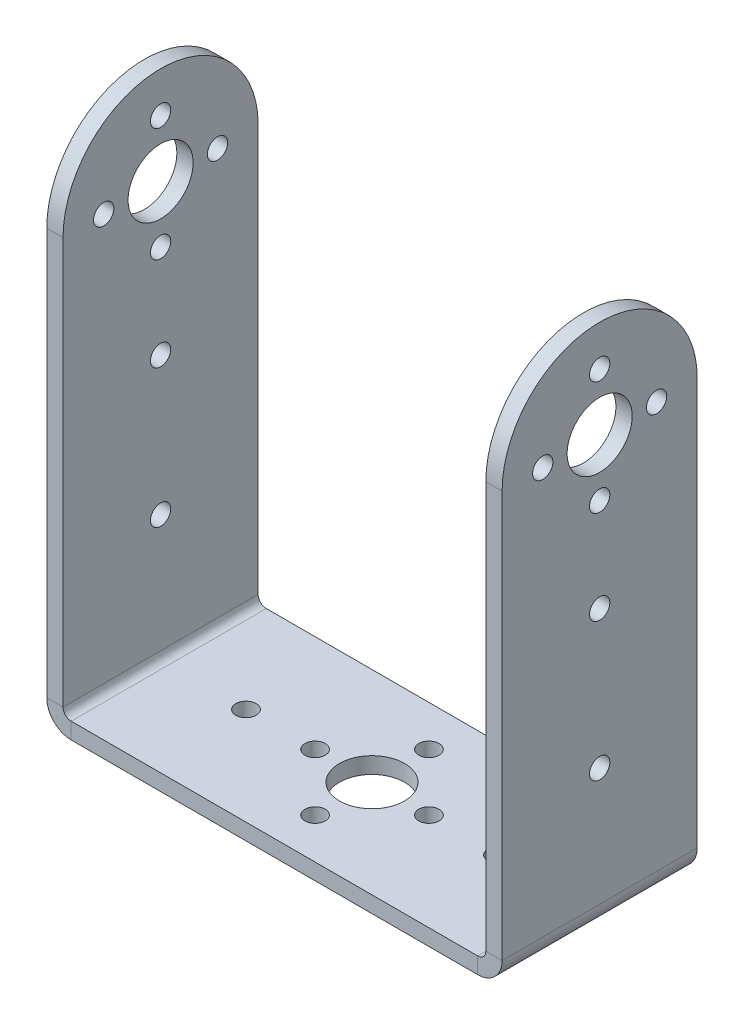
ISO-10303-21;
HEADER;
FILE_DESCRIPTION(('STEP AP214'),'2;1');
FILE_NAME('part.step','',(''),(''),'','','');
FILE_SCHEMA(('AUTOMOTIVE_DESIGN { 1 0 10303 214 1 1 1 1 }'));
ENDSEC;
DATA;
#1=APPLICATION_CONTEXT('core data for automotive mechanical design processes');
#2=APPLICATION_PROTOCOL_DEFINITION('international standard','automotive_design',2000,#1);
#3=PRODUCT_CONTEXT('',#1,'mechanical');
#4=PRODUCT('Part','Part','',(#3));
#5=PRODUCT_RELATED_PRODUCT_CATEGORY('part','',(#4));
#6=PRODUCT_DEFINITION_FORMATION('','',#4);
#7=PRODUCT_DEFINITION_CONTEXT('part definition',#1,'design');
#8=PRODUCT_DEFINITION('design','',#6,#7);
#9=PRODUCT_DEFINITION_SHAPE('','',#8);
#10=(LENGTH_UNIT() NAMED_UNIT(*) SI_UNIT(.MILLI.,.METRE.));
#11=(NAMED_UNIT(*) PLANE_ANGLE_UNIT() SI_UNIT($,.RADIAN.));
#12=(NAMED_UNIT(*) SI_UNIT($,.STERADIAN.) SOLID_ANGLE_UNIT());
#13=UNCERTAINTY_MEASURE_WITH_UNIT(LENGTH_MEASURE(1.E-05),#10,'distance_accuracy_value','');
#14=(GEOMETRIC_REPRESENTATION_CONTEXT(3) GLOBAL_UNCERTAINTY_ASSIGNED_CONTEXT((#13)) GLOBAL_UNIT_ASSIGNED_CONTEXT((#10,
#11,#12)) REPRESENTATION_CONTEXT('',''));
#15=CARTESIAN_POINT('',(0.,0.,0.));
#16=DIRECTION('',(0.,0.,1.));
#17=DIRECTION('',(1.,0.,0.));
#18=AXIS2_PLACEMENT_3D('',#15,#16,#17);
#19=CARTESIAN_POINT('',(28.,0.,12.));
#20=DIRECTION('',(-1.,0.,0.));
#21=DIRECTION('',(0.,-1.,0.));
#22=AXIS2_PLACEMENT_3D('',#19,#20,#21);
#23=PLANE('',#22);
#24=CARTESIAN_POINT('',(28.,60.,0.));
#25=DIRECTION('',(1.,0.,0.));
#26=DIRECTION('',(0.,0.,-1.));
#27=AXIS2_PLACEMENT_3D('',#24,#25,#26);
#28=CIRCLE('',#27,1.25);
#29=CARTESIAN_POINT('',(28.,60.,-1.25));
#30=VERTEX_POINT('',#29);
#31=EDGE_CURVE('E377',#30,#30,#28,.T.);
#32=ORIENTED_EDGE('',*,*,#31,.F.);
#33=EDGE_LOOP('',(#32));
#34=FACE_BOUND('',#33,.T.);
#35=CARTESIAN_POINT('',(28.,53.,-7.));
#36=DIRECTION('',(1.,0.,0.));
#37=DIRECTION('',(0.,0.,-1.));
#38=AXIS2_PLACEMENT_3D('',#35,#36,#37);
#39=CIRCLE('',#38,1.25);
#40=CARTESIAN_POINT('',(28.,53.,-8.25));
#41=VERTEX_POINT('',#40);
#42=EDGE_CURVE('E365',#41,#41,#39,.T.);
#43=ORIENTED_EDGE('',*,*,#42,.F.);
#44=EDGE_LOOP('',(#43));
#45=FACE_BOUND('',#44,.T.);
#46=CARTESIAN_POINT('',(28.,46.,0.));
#47=DIRECTION('',(1.,0.,0.));
#48=DIRECTION('',(0.,0.,-1.));
#49=AXIS2_PLACEMENT_3D('',#46,#47,#48);
#50=CIRCLE('',#49,1.25);
#51=CARTESIAN_POINT('',(28.,46.,-1.25));
#52=VERTEX_POINT('',#51);
#53=EDGE_CURVE('E353',#52,#52,#50,.T.);
#54=ORIENTED_EDGE('',*,*,#53,.F.);
#55=EDGE_LOOP('',(#54));
#56=FACE_BOUND('',#55,.T.);
#57=CARTESIAN_POINT('',(28.,34.5,0.));
#58=DIRECTION('',(1.,0.,0.));
#59=DIRECTION('',(0.,0.,-1.));
#60=AXIS2_PLACEMENT_3D('',#57,#58,#59);
#61=CIRCLE('',#60,1.25);
#62=CARTESIAN_POINT('',(28.,34.5,-1.25));
#63=VERTEX_POINT('',#62);
#64=EDGE_CURVE('E329',#63,#63,#61,.T.);
#65=ORIENTED_EDGE('',*,*,#64,.F.);
#66=EDGE_LOOP('',(#65));
#67=FACE_BOUND('',#66,.T.);
#68=CARTESIAN_POINT('',(28.,17.5,0.));
#69=DIRECTION('',(1.,0.,0.));
#70=DIRECTION('',(0.,0.,-1.));
#71=AXIS2_PLACEMENT_3D('',#68,#69,#70);
#72=CIRCLE('',#71,1.25);
#73=CARTESIAN_POINT('',(28.,17.5,-1.25));
#74=VERTEX_POINT('',#73);
#75=EDGE_CURVE('E317',#74,#74,#72,.T.);
#76=ORIENTED_EDGE('',*,*,#75,.F.);
#77=EDGE_LOOP('',(#76));
#78=FACE_BOUND('',#77,.T.);
#79=CARTESIAN_POINT('',(28.,53.,0.));
#80=DIRECTION('',(1.,0.,0.));
#81=DIRECTION('',(0.,0.,-1.));
#82=AXIS2_PLACEMENT_3D('',#79,#80,#81);
#83=CIRCLE('',#82,4.);
#84=CARTESIAN_POINT('',(28.,53.,-4.));
#85=VERTEX_POINT('',#84);
#86=EDGE_CURVE('E305',#85,#85,#83,.T.);
#87=ORIENTED_EDGE('',*,*,#86,.F.);
#88=EDGE_LOOP('',(#87));
#89=FACE_BOUND('',#88,.T.);
#90=DIRECTION('',(0.,1.,0.));
#91=VECTOR('',#90,1.);
#92=CARTESIAN_POINT('',(28.,0.,-12.));
#93=LINE('',#92,#91);
#94=CARTESIAN_POINT('',(28.,3.,-12.));
#95=VERTEX_POINT('',#94);
#96=CARTESIAN_POINT('',(28.,53.,-12.));
#97=VERTEX_POINT('',#96);
#98=EDGE_CURVE('E162',#95,#97,#93,.T.);
#99=ORIENTED_EDGE('',*,*,#98,.T.);
#100=CARTESIAN_POINT('',(28.,53.,0.));
#101=DIRECTION('',(-1.,0.,0.));
#102=DIRECTION('',(0.,-1.,0.));
#103=AXIS2_PLACEMENT_3D('',#100,#101,#102);
#104=CIRCLE('',#103,12.);
#105=CARTESIAN_POINT('',(28.,53.,12.));
#106=VERTEX_POINT('',#105);
#107=EDGE_CURVE('E270',#97,#106,#104,.F.);
#108=ORIENTED_EDGE('',*,*,#107,.T.);
#109=DIRECTION('',(0.,1.,0.));
#110=VECTOR('',#109,1.);
#111=CARTESIAN_POINT('',(28.,0.,12.));
#112=LINE('',#111,#110);
#113=CARTESIAN_POINT('',(28.,3.,12.));
#114=VERTEX_POINT('',#113);
#115=EDGE_CURVE('E186',#114,#106,#112,.T.);
#116=ORIENTED_EDGE('',*,*,#115,.F.);
#117=DIRECTION('',(0.,0.,-1.));
#118=VECTOR('',#117,1.);
#119=CARTESIAN_POINT('',(28.,3.,12.));
#120=LINE('',#119,#118);
#121=EDGE_CURVE('E158',#114,#95,#120,.T.);
#122=ORIENTED_EDGE('',*,*,#121,.T.);
#123=EDGE_LOOP('',(#99,#108,#116,#122));
#124=FACE_BOUND('',#123,.T.);
#125=CARTESIAN_POINT('',(28.,53.,7.));
#126=DIRECTION('',(1.,0.,0.));
#127=DIRECTION('',(0.,0.,-1.));
#128=AXIS2_PLACEMENT_3D('',#125,#126,#127);
#129=CIRCLE('',#128,1.25);
#130=CARTESIAN_POINT('',(28.,53.,5.75));
#131=VERTEX_POINT('',#130);
#132=EDGE_CURVE('E341',#131,#131,#129,.T.);
#133=ORIENTED_EDGE('',*,*,#132,.F.);
#134=EDGE_LOOP('',(#133));
#135=FACE_BOUND('',#134,.T.);
#136=ADVANCED_FACE('F37',(#34,#45,#56,#67,#78,#89,#124,#135),#23,.F.);
#137=CARTESIAN_POINT('',(26.,0.,12.));
#138=DIRECTION('',(-1.,0.,0.));
#139=DIRECTION('',(0.,-1.,0.));
#140=AXIS2_PLACEMENT_3D('',#137,#138,#139);
#141=PLANE('',#140);
#142=CARTESIAN_POINT('',(26.,60.,0.));
#143=DIRECTION('',(-1.,0.,0.));
#144=DIRECTION('',(0.,-1.,0.));
#145=AXIS2_PLACEMENT_3D('',#142,#143,#144);
#146=CIRCLE('',#145,1.25);
#147=CARTESIAN_POINT('',(26.,58.75,0.));
#148=VERTEX_POINT('',#147);
#149=EDGE_CURVE('E368',#148,#148,#146,.T.);
#150=ORIENTED_EDGE('',*,*,#149,.F.);
#151=EDGE_LOOP('',(#150));
#152=FACE_BOUND('',#151,.T.);
#153=CARTESIAN_POINT('',(26.,53.,-7.));
#154=DIRECTION('',(-1.,0.,0.));
#155=DIRECTION('',(0.,-1.,0.));
#156=AXIS2_PLACEMENT_3D('',#153,#154,#155);
#157=CIRCLE('',#156,1.25);
#158=CARTESIAN_POINT('',(26.,51.75,-7.));
#159=VERTEX_POINT('',#158);
#160=EDGE_CURVE('E356',#159,#159,#157,.T.);
#161=ORIENTED_EDGE('',*,*,#160,.F.);
#162=EDGE_LOOP('',(#161));
#163=FACE_BOUND('',#162,.T.);
#164=CARTESIAN_POINT('',(26.,46.,0.));
#165=DIRECTION('',(-1.,0.,0.));
#166=DIRECTION('',(0.,-1.,0.));
#167=AXIS2_PLACEMENT_3D('',#164,#165,#166);
#168=CIRCLE('',#167,1.25);
#169=CARTESIAN_POINT('',(26.,44.75,0.));
#170=VERTEX_POINT('',#169);
#171=EDGE_CURVE('E344',#170,#170,#168,.T.);
#172=ORIENTED_EDGE('',*,*,#171,.F.);
#173=EDGE_LOOP('',(#172));
#174=FACE_BOUND('',#173,.T.);
#175=CARTESIAN_POINT('',(26.,53.,7.));
#176=DIRECTION('',(-1.,0.,0.));
#177=DIRECTION('',(0.,-1.,0.));
#178=AXIS2_PLACEMENT_3D('',#175,#176,#177);
#179=CIRCLE('',#178,1.25);
#180=CARTESIAN_POINT('',(26.,51.75,7.));
#181=VERTEX_POINT('',#180);
#182=EDGE_CURVE('E332',#181,#181,#179,.T.);
#183=ORIENTED_EDGE('',*,*,#182,.F.);
#184=EDGE_LOOP('',(#183));
#185=FACE_BOUND('',#184,.T.);
#186=CARTESIAN_POINT('',(26.,34.5,0.));
#187=DIRECTION('',(-1.,0.,0.));
#188=DIRECTION('',(0.,-1.,0.));
#189=AXIS2_PLACEMENT_3D('',#186,#187,#188);
#190=CIRCLE('',#189,1.25);
#191=CARTESIAN_POINT('',(26.,33.25,0.));
#192=VERTEX_POINT('',#191);
#193=EDGE_CURVE('E320',#192,#192,#190,.T.);
#194=ORIENTED_EDGE('',*,*,#193,.F.);
#195=EDGE_LOOP('',(#194));
#196=FACE_BOUND('',#195,.T.);
#197=CARTESIAN_POINT('',(26.,17.5,0.));
#198=DIRECTION('',(-1.,0.,0.));
#199=DIRECTION('',(0.,-1.,0.));
#200=AXIS2_PLACEMENT_3D('',#197,#198,#199);
#201=CIRCLE('',#200,1.25);
#202=CARTESIAN_POINT('',(26.,16.25,0.));
#203=VERTEX_POINT('',#202);
#204=EDGE_CURVE('E311',#203,#203,#201,.T.);
#205=ORIENTED_EDGE('',*,*,#204,.F.);
#206=EDGE_LOOP('',(#205));
#207=FACE_BOUND('',#206,.T.);
#208=CARTESIAN_POINT('',(26.,53.,0.));
#209=DIRECTION('',(-1.,0.,0.));
#210=DIRECTION('',(0.,-1.,0.));
#211=AXIS2_PLACEMENT_3D('',#208,#209,#210);
#212=CIRCLE('',#211,4.);
#213=CARTESIAN_POINT('',(26.,49.,0.));
#214=VERTEX_POINT('',#213);
#215=EDGE_CURVE('E279',#214,#214,#212,.T.);
#216=ORIENTED_EDGE('',*,*,#215,.F.);
#217=EDGE_LOOP('',(#216));
#218=FACE_BOUND('',#217,.T.);
#219=CARTESIAN_POINT('',(26.,53.,0.));
#220=DIRECTION('',(-1.,0.,0.));
#221=DIRECTION('',(0.,-1.,0.));
#222=AXIS2_PLACEMENT_3D('',#219,#220,#221);
#223=CIRCLE('',#222,12.);
#224=CARTESIAN_POINT('',(26.,53.,-12.));
#225=VERTEX_POINT('',#224);
#226=CARTESIAN_POINT('',(26.,53.,12.));
#227=VERTEX_POINT('',#226);
#228=EDGE_CURVE('E52',#225,#227,#223,.F.);
#229=ORIENTED_EDGE('',*,*,#228,.F.);
#230=DIRECTION('',(0.,1.,0.));
#231=VECTOR('',#230,1.);
#232=CARTESIAN_POINT('',(26.,0.,-12.));
#233=LINE('',#232,#231);
#234=CARTESIAN_POINT('',(26.,3.,-12.));
#235=VERTEX_POINT('',#234);
#236=EDGE_CURVE('E165',#235,#225,#233,.T.);
#237=ORIENTED_EDGE('',*,*,#236,.F.);
#238=DIRECTION('',(0.,0.,-1.));
#239=VECTOR('',#238,1.);
#240=CARTESIAN_POINT('',(26.,3.,12.));
#241=LINE('',#240,#239);
#242=CARTESIAN_POINT('',(26.,3.,12.));
#243=VERTEX_POINT('',#242);
#244=EDGE_CURVE('E200',#243,#235,#241,.T.);
#245=ORIENTED_EDGE('',*,*,#244,.F.);
#246=DIRECTION('',(0.,1.,0.));
#247=VECTOR('',#246,1.);
#248=CARTESIAN_POINT('',(26.,0.,12.));
#249=LINE('',#248,#247);
#250=EDGE_CURVE('E268',#243,#227,#249,.T.);
#251=ORIENTED_EDGE('',*,*,#250,.T.);
#252=EDGE_LOOP('',(#229,#237,#245,#251));
#253=FACE_BOUND('',#252,.T.);
#254=ADVANCED_FACE('F267',(#152,#163,#174,#185,#196,#207,#218,#253),#141,.T.);
#255=CARTESIAN_POINT('',(-26.,65.,12.));
#256=DIRECTION('',(1.,0.,0.));
#257=DIRECTION('',(0.,1.,0.));
#258=AXIS2_PLACEMENT_3D('',#255,#256,#257);
#259=PLANE('',#258);
#260=CARTESIAN_POINT('',(-26.,60.,0.));
#261=DIRECTION('',(1.,0.,0.));
#262=DIRECTION('',(0.,1.,0.));
#263=AXIS2_PLACEMENT_3D('',#260,#261,#262);
#264=CIRCLE('',#263,1.25);
#265=CARTESIAN_POINT('',(-26.,61.25,0.));
#266=VERTEX_POINT('',#265);
#267=EDGE_CURVE('E371',#266,#266,#264,.T.);
#268=ORIENTED_EDGE('',*,*,#267,.F.);
#269=EDGE_LOOP('',(#268));
#270=FACE_BOUND('',#269,.T.);
#271=CARTESIAN_POINT('',(-26.,53.,-7.));
#272=DIRECTION('',(1.,0.,0.));
#273=DIRECTION('',(0.,1.,0.));
#274=AXIS2_PLACEMENT_3D('',#271,#272,#273);
#275=CIRCLE('',#274,1.25);
#276=CARTESIAN_POINT('',(-26.,54.25,-7.));
#277=VERTEX_POINT('',#276);
#278=EDGE_CURVE('E359',#277,#277,#275,.T.);
#279=ORIENTED_EDGE('',*,*,#278,.F.);
#280=EDGE_LOOP('',(#279));
#281=FACE_BOUND('',#280,.T.);
#282=CARTESIAN_POINT('',(-26.,46.,0.));
#283=DIRECTION('',(1.,0.,0.));
#284=DIRECTION('',(0.,1.,0.));
#285=AXIS2_PLACEMENT_3D('',#282,#283,#284);
#286=CIRCLE('',#285,1.25);
#287=CARTESIAN_POINT('',(-26.,47.25,0.));
#288=VERTEX_POINT('',#287);
#289=EDGE_CURVE('E347',#288,#288,#286,.T.);
#290=ORIENTED_EDGE('',*,*,#289,.F.);
#291=EDGE_LOOP('',(#290));
#292=FACE_BOUND('',#291,.T.);
#293=CARTESIAN_POINT('',(-26.,53.,7.));
#294=DIRECTION('',(1.,0.,0.));
#295=DIRECTION('',(0.,1.,0.));
#296=AXIS2_PLACEMENT_3D('',#293,#294,#295);
#297=CIRCLE('',#296,1.25);
#298=CARTESIAN_POINT('',(-26.,54.25,7.));
#299=VERTEX_POINT('',#298);
#300=EDGE_CURVE('E335',#299,#299,#297,.T.);
#301=ORIENTED_EDGE('',*,*,#300,.F.);
#302=EDGE_LOOP('',(#301));
#303=FACE_BOUND('',#302,.T.);
#304=CARTESIAN_POINT('',(-26.,34.5,0.));
#305=DIRECTION('',(1.,0.,0.));
#306=DIRECTION('',(0.,1.,0.));
#307=AXIS2_PLACEMENT_3D('',#304,#305,#306);
#308=CIRCLE('',#307,1.25);
#309=CARTESIAN_POINT('',(-26.,35.75,0.));
#310=VERTEX_POINT('',#309);
#311=EDGE_CURVE('E323',#310,#310,#308,.T.);
#312=ORIENTED_EDGE('',*,*,#311,.F.);
#313=EDGE_LOOP('',(#312));
#314=FACE_BOUND('',#313,.T.);
#315=CARTESIAN_POINT('',(-26.,17.5,0.));
#316=DIRECTION('',(1.,0.,0.));
#317=DIRECTION('',(0.,1.,0.));
#318=AXIS2_PLACEMENT_3D('',#315,#316,#317);
#319=CIRCLE('',#318,1.25);
#320=CARTESIAN_POINT('',(-26.,18.75,0.));
#321=VERTEX_POINT('',#320);
#322=EDGE_CURVE('E308',#321,#321,#319,.T.);
#323=ORIENTED_EDGE('',*,*,#322,.F.);
#324=EDGE_LOOP('',(#323));
#325=FACE_BOUND('',#324,.T.);
#326=CARTESIAN_POINT('',(-26.,53.,0.));
#327=DIRECTION('',(1.,0.,0.));
#328=DIRECTION('',(0.,1.,0.));
#329=AXIS2_PLACEMENT_3D('',#326,#327,#328);
#330=CIRCLE('',#329,4.);
#331=CARTESIAN_POINT('',(-26.,57.,0.));
#332=VERTEX_POINT('',#331);
#333=EDGE_CURVE('E299',#332,#332,#330,.T.);
#334=ORIENTED_EDGE('',*,*,#333,.F.);
#335=EDGE_LOOP('',(#334));
#336=FACE_BOUND('',#335,.T.);
#337=DIRECTION('',(0.,-1.,0.));
#338=VECTOR('',#337,1.);
#339=CARTESIAN_POINT('',(-26.,65.,-12.));
#340=LINE('',#339,#338);
#341=CARTESIAN_POINT('',(-26.,53.,-12.));
#342=VERTEX_POINT('',#341);
#343=CARTESIAN_POINT('',(-26.,3.,-12.));
#344=VERTEX_POINT('',#343);
#345=EDGE_CURVE('E177',#342,#344,#340,.T.);
#346=ORIENTED_EDGE('',*,*,#345,.F.);
#347=CARTESIAN_POINT('',(-26.,53.,0.));
#348=DIRECTION('',(1.,0.,0.));
#349=DIRECTION('',(0.,1.,0.));
#350=AXIS2_PLACEMENT_3D('',#347,#348,#349);
#351=CIRCLE('',#350,12.);
#352=CARTESIAN_POINT('',(-26.,53.,12.));
#353=VERTEX_POINT('',#352);
#354=EDGE_CURVE('E290',#353,#342,#351,.F.);
#355=ORIENTED_EDGE('',*,*,#354,.F.);
#356=DIRECTION('',(0.,-1.,0.));
#357=VECTOR('',#356,1.);
#358=CARTESIAN_POINT('',(-26.,65.,12.));
#359=LINE('',#358,#357);
#360=CARTESIAN_POINT('',(-26.,3.,12.));
#361=VERTEX_POINT('',#360);
#362=EDGE_CURVE('E235',#353,#361,#359,.T.);
#363=ORIENTED_EDGE('',*,*,#362,.T.);
#364=DIRECTION('',(0.,0.,-1.));
#365=VECTOR('',#364,1.);
#366=CARTESIAN_POINT('',(-26.,3.,12.));
#367=LINE('',#366,#365);
#368=EDGE_CURVE('E191',#361,#344,#367,.T.);
#369=ORIENTED_EDGE('',*,*,#368,.T.);
#370=EDGE_LOOP('',(#346,#355,#363,#369));
#371=FACE_BOUND('',#370,.T.);
#372=ADVANCED_FACE('F231',(#270,#281,#292,#303,#314,#325,#336,#371),#259,.T.);
#373=CARTESIAN_POINT('',(-28.,65.,12.));
#374=DIRECTION('',(1.,0.,0.));
#375=DIRECTION('',(0.,1.,0.));
#376=AXIS2_PLACEMENT_3D('',#373,#374,#375);
#377=PLANE('',#376);
#378=CARTESIAN_POINT('',(-28.,60.,0.));
#379=DIRECTION('',(1.,0.,0.));
#380=DIRECTION('',(0.,0.,-1.));
#381=AXIS2_PLACEMENT_3D('',#378,#379,#380);
#382=CIRCLE('',#381,1.24999999999999);
#383=CARTESIAN_POINT('',(-28.,60.,-1.24999999999999));
#384=VERTEX_POINT('',#383);
#385=EDGE_CURVE('E374',#384,#384,#382,.T.);
#386=ORIENTED_EDGE('',*,*,#385,.T.);
#387=EDGE_LOOP('',(#386));
#388=FACE_BOUND('',#387,.T.);
#389=CARTESIAN_POINT('',(-28.,53.,-7.));
#390=DIRECTION('',(1.,0.,0.));
#391=DIRECTION('',(0.,0.,-1.));
#392=AXIS2_PLACEMENT_3D('',#389,#390,#391);
#393=CIRCLE('',#392,1.24999999999999);
#394=CARTESIAN_POINT('',(-28.,53.,-8.24999999999999));
#395=VERTEX_POINT('',#394);
#396=EDGE_CURVE('E362',#395,#395,#393,.T.);
#397=ORIENTED_EDGE('',*,*,#396,.T.);
#398=EDGE_LOOP('',(#397));
#399=FACE_BOUND('',#398,.T.);
#400=CARTESIAN_POINT('',(-28.,46.,0.));
#401=DIRECTION('',(1.,0.,0.));
#402=DIRECTION('',(0.,0.,-1.));
#403=AXIS2_PLACEMENT_3D('',#400,#401,#402);
#404=CIRCLE('',#403,1.24999999999999);
#405=CARTESIAN_POINT('',(-28.,46.,-1.24999999999999));
#406=VERTEX_POINT('',#405);
#407=EDGE_CURVE('E350',#406,#406,#404,.T.);
#408=ORIENTED_EDGE('',*,*,#407,.T.);
#409=EDGE_LOOP('',(#408));
#410=FACE_BOUND('',#409,.T.);
#411=CARTESIAN_POINT('',(-28.,53.,7.));
#412=DIRECTION('',(1.,0.,0.));
#413=DIRECTION('',(0.,0.,-1.));
#414=AXIS2_PLACEMENT_3D('',#411,#412,#413);
#415=CIRCLE('',#414,1.24999999999999);
#416=CARTESIAN_POINT('',(-28.,53.,5.75000000000001));
#417=VERTEX_POINT('',#416);
#418=EDGE_CURVE('E338',#417,#417,#415,.T.);
#419=ORIENTED_EDGE('',*,*,#418,.T.);
#420=EDGE_LOOP('',(#419));
#421=FACE_BOUND('',#420,.T.);
#422=CARTESIAN_POINT('',(-28.,34.5,0.));
#423=DIRECTION('',(1.,0.,0.));
#424=DIRECTION('',(0.,0.,-1.));
#425=AXIS2_PLACEMENT_3D('',#422,#423,#424);
#426=CIRCLE('',#425,1.24999999999999);
#427=CARTESIAN_POINT('',(-28.,34.5,-1.24999999999999));
#428=VERTEX_POINT('',#427);
#429=EDGE_CURVE('E326',#428,#428,#426,.T.);
#430=ORIENTED_EDGE('',*,*,#429,.T.);
#431=EDGE_LOOP('',(#430));
#432=FACE_BOUND('',#431,.T.);
#433=CARTESIAN_POINT('',(-28.,17.5,0.));
#434=DIRECTION('',(1.,0.,0.));
#435=DIRECTION('',(0.,0.,-1.));
#436=AXIS2_PLACEMENT_3D('',#433,#434,#435);
#437=CIRCLE('',#436,1.24999999999999);
#438=CARTESIAN_POINT('',(-28.,17.5,-1.24999999999999));
#439=VERTEX_POINT('',#438);
#440=EDGE_CURVE('E314',#439,#439,#437,.T.);
#441=ORIENTED_EDGE('',*,*,#440,.T.);
#442=EDGE_LOOP('',(#441));
#443=FACE_BOUND('',#442,.T.);
#444=CARTESIAN_POINT('',(-28.,53.,0.));
#445=DIRECTION('',(1.,0.,0.));
#446=DIRECTION('',(0.,0.,-1.));
#447=AXIS2_PLACEMENT_3D('',#444,#445,#446);
#448=CIRCLE('',#447,4.);
#449=CARTESIAN_POINT('',(-28.,53.,-4.));
#450=VERTEX_POINT('',#449);
#451=EDGE_CURVE('E302',#450,#450,#448,.T.);
#452=ORIENTED_EDGE('',*,*,#451,.T.);
#453=EDGE_LOOP('',(#452));
#454=FACE_BOUND('',#453,.T.);
#455=CARTESIAN_POINT('',(-28.,53.,0.));
#456=DIRECTION('',(1.,0.,0.));
#457=DIRECTION('',(0.,1.,0.));
#458=AXIS2_PLACEMENT_3D('',#455,#456,#457);
#459=CIRCLE('',#458,12.);
#460=CARTESIAN_POINT('',(-28.,53.,12.));
#461=VERTEX_POINT('',#460);
#462=CARTESIAN_POINT('',(-28.,53.,-12.));
#463=VERTEX_POINT('',#462);
#464=EDGE_CURVE('E251',#461,#463,#459,.F.);
#465=ORIENTED_EDGE('',*,*,#464,.T.);
#466=DIRECTION('',(0.,-1.,0.));
#467=VECTOR('',#466,1.);
#468=CARTESIAN_POINT('',(-28.,65.,-12.));
#469=LINE('',#468,#467);
#470=CARTESIAN_POINT('',(-28.,3.,-12.));
#471=VERTEX_POINT('',#470);
#472=EDGE_CURVE('E179',#463,#471,#469,.T.);
#473=ORIENTED_EDGE('',*,*,#472,.T.);
#474=DIRECTION('',(0.,0.,-1.));
#475=VECTOR('',#474,1.);
#476=CARTESIAN_POINT('',(-28.,3.,12.));
#477=LINE('',#476,#475);
#478=CARTESIAN_POINT('',(-28.,3.,12.));
#479=VERTEX_POINT('',#478);
#480=EDGE_CURVE('E150',#479,#471,#477,.T.);
#481=ORIENTED_EDGE('',*,*,#480,.F.);
#482=DIRECTION('',(0.,-1.,0.));
#483=VECTOR('',#482,1.);
#484=CARTESIAN_POINT('',(-28.,65.,12.));
#485=LINE('',#484,#483);
#486=EDGE_CURVE('E139',#461,#479,#485,.T.);
#487=ORIENTED_EDGE('',*,*,#486,.F.);
#488=EDGE_LOOP('',(#465,#473,#481,#487));
#489=FACE_BOUND('',#488,.T.);
#490=ADVANCED_FACE('F248',(#388,#399,#410,#421,#432,#443,#454,#489),#377,.F.);
#491=CARTESIAN_POINT('',(25.,3.,12.));
#492=DIRECTION('',(0.,0.,1.));
#493=DIRECTION('',(1.,0.,0.));
#494=AXIS2_PLACEMENT_3D('',#491,#492,#493);
#495=PLANE('',#494);
#496=ORIENTED_EDGE('',*,*,#115,.T.);
#497=DIRECTION('',(1.,0.,0.));
#498=VECTOR('',#497,1.);
#499=CARTESIAN_POINT('',(28.,53.,12.));
#500=LINE('',#499,#498);
#501=EDGE_CURVE('E269',#106,#227,#500,.F.);
#502=ORIENTED_EDGE('',*,*,#501,.T.);
#503=ORIENTED_EDGE('',*,*,#250,.F.);
#504=DIRECTION('',(1.,0.,0.));
#505=VECTOR('',#504,1.);
#506=CARTESIAN_POINT('',(26.,3.,12.));
#507=LINE('',#506,#505);
#508=EDGE_CURVE('E61',#243,#114,#507,.T.);
#509=ORIENTED_EDGE('',*,*,#508,.T.);
#510=EDGE_LOOP('',(#496,#502,#503,#509));
#511=FACE_BOUND('',#510,.T.);
#512=ADVANCED_FACE('F285',(#511),#495,.T.);
#513=CARTESIAN_POINT('',(-28.,3.,12.));
#514=DIRECTION('',(0.,0.,1.));
#515=DIRECTION('',(1.,0.,0.));
#516=AXIS2_PLACEMENT_3D('',#513,#514,#515);
#517=PLANE('',#516);
#518=DIRECTION('',(1.,0.,0.));
#519=VECTOR('',#518,1.);
#520=CARTESIAN_POINT('',(-28.,3.,12.));
#521=LINE('',#520,#519);
#522=EDGE_CURVE('E11',#479,#361,#521,.T.);
#523=ORIENTED_EDGE('',*,*,#522,.F.);
#524=CARTESIAN_POINT('',(-25.,3.,12.));
#525=DIRECTION('',(0.,0.,-1.));
#526=DIRECTION('',(-1.,0.,0.));
#527=AXIS2_PLACEMENT_3D('',#524,#525,#526);
#528=CIRCLE('',#527,3.);
#529=CARTESIAN_POINT('',(-25.,0.,12.));
#530=VERTEX_POINT('',#529);
#531=EDGE_CURVE('E134',#479,#530,#528,.F.);
#532=ORIENTED_EDGE('',*,*,#531,.T.);
#533=DIRECTION('',(0.,-1.,0.));
#534=VECTOR('',#533,1.);
#535=CARTESIAN_POINT('',(-25.,2.,12.));
#536=LINE('',#535,#534);
#537=CARTESIAN_POINT('',(-25.,2.,12.));
#538=VERTEX_POINT('',#537);
#539=EDGE_CURVE('E45',#538,#530,#536,.T.);
#540=ORIENTED_EDGE('',*,*,#539,.F.);
#541=CARTESIAN_POINT('',(-25.,3.,12.));
#542=DIRECTION('',(0.,0.,1.));
#543=DIRECTION('',(1.,0.,0.));
#544=AXIS2_PLACEMENT_3D('',#541,#542,#543);
#545=CIRCLE('',#544,1.);
#546=EDGE_CURVE('E220',#361,#538,#545,.T.);
#547=ORIENTED_EDGE('',*,*,#546,.F.);
#548=EDGE_LOOP('',(#523,#532,#540,#547));
#549=FACE_BOUND('',#548,.T.);
#550=ADVANCED_FACE('F39',(#549),#517,.T.);
#551=CARTESIAN_POINT('',(-25.,2.,12.));
#552=DIRECTION('',(0.,0.,1.));
#553=DIRECTION('',(1.,0.,0.));
#554=AXIS2_PLACEMENT_3D('',#551,#552,#553);
#555=PLANE('',#554);
#556=DIRECTION('',(1.,0.,0.));
#557=VECTOR('',#556,1.);
#558=CARTESIAN_POINT('',(-26.,53.,12.));
#559=LINE('',#558,#557);
#560=EDGE_CURVE('E166',#353,#461,#559,.F.);
#561=ORIENTED_EDGE('',*,*,#560,.T.);
#562=ORIENTED_EDGE('',*,*,#486,.T.);
#563=ORIENTED_EDGE('',*,*,#522,.T.);
#564=ORIENTED_EDGE('',*,*,#362,.F.);
#565=EDGE_LOOP('',(#561,#562,#563,#564));
#566=FACE_BOUND('',#565,.T.);
#567=ADVANCED_FACE('F244',(#566),#555,.T.);
#568=CARTESIAN_POINT('',(-25.,0.,-12.));
#569=DIRECTION('',(0.,0.,-1.));
#570=DIRECTION('',(-1.,0.,0.));
#571=AXIS2_PLACEMENT_3D('',#568,#569,#570);
#572=PLANE('',#571);
#573=DIRECTION('',(0.,1.,0.));
#574=VECTOR('',#573,1.);
#575=CARTESIAN_POINT('',(-25.,0.,-12.));
#576=LINE('',#575,#574);
#577=CARTESIAN_POINT('',(-25.,0.,-12.));
#578=VERTEX_POINT('',#577);
#579=CARTESIAN_POINT('',(-25.,2.,-12.));
#580=VERTEX_POINT('',#579);
#581=EDGE_CURVE('E131',#578,#580,#576,.T.);
#582=ORIENTED_EDGE('',*,*,#581,.F.);
#583=CARTESIAN_POINT('',(-25.,3.,-12.));
#584=DIRECTION('',(0.,0.,-1.));
#585=DIRECTION('',(-1.,0.,0.));
#586=AXIS2_PLACEMENT_3D('',#583,#584,#585);
#587=CIRCLE('',#586,3.);
#588=EDGE_CURVE('E146',#471,#578,#587,.F.);
#589=ORIENTED_EDGE('',*,*,#588,.F.);
#590=DIRECTION('',(-1.,0.,0.));
#591=VECTOR('',#590,1.);
#592=CARTESIAN_POINT('',(-26.,3.,-12.));
#593=LINE('',#592,#591);
#594=EDGE_CURVE('E209',#344,#471,#593,.T.);
#595=ORIENTED_EDGE('',*,*,#594,.F.);
#596=CARTESIAN_POINT('',(-25.,3.,-12.));
#597=DIRECTION('',(0.,0.,1.));
#598=DIRECTION('',(1.,0.,0.));
#599=AXIS2_PLACEMENT_3D('',#596,#597,#598);
#600=CIRCLE('',#599,1.);
#601=EDGE_CURVE('E174',#344,#580,#600,.T.);
#602=ORIENTED_EDGE('',*,*,#601,.T.);
#603=EDGE_LOOP('',(#582,#589,#595,#602));
#604=FACE_BOUND('',#603,.T.);
#605=ADVANCED_FACE('F226',(#604),#572,.T.);
#606=CARTESIAN_POINT('',(-26.,3.,-12.));
#607=DIRECTION('',(0.,0.,-1.));
#608=DIRECTION('',(-1.,0.,0.));
#609=AXIS2_PLACEMENT_3D('',#606,#607,#608);
#610=PLANE('',#609);
#611=DIRECTION('',(1.,0.,0.));
#612=VECTOR('',#611,1.);
#613=CARTESIAN_POINT('',(-28.,0.,-12.));
#614=LINE('',#613,#612);
#615=CARTESIAN_POINT('',(25.,0.,-12.));
#616=VERTEX_POINT('',#615);
#617=EDGE_CURVE('E182',#578,#616,#614,.T.);
#618=ORIENTED_EDGE('',*,*,#617,.F.);
#619=ORIENTED_EDGE('',*,*,#581,.T.);
#620=DIRECTION('',(1.,0.,0.));
#621=VECTOR('',#620,1.);
#622=CARTESIAN_POINT('',(-28.,2.,-12.));
#623=LINE('',#622,#621);
#624=CARTESIAN_POINT('',(25.,2.,-12.));
#625=VERTEX_POINT('',#624);
#626=EDGE_CURVE('E171',#580,#625,#623,.T.);
#627=ORIENTED_EDGE('',*,*,#626,.T.);
#628=DIRECTION('',(0.,-1.,0.));
#629=VECTOR('',#628,1.);
#630=CARTESIAN_POINT('',(25.,2.,-12.));
#631=LINE('',#630,#629);
#632=EDGE_CURVE('E203',#625,#616,#631,.T.);
#633=ORIENTED_EDGE('',*,*,#632,.T.);
#634=EDGE_LOOP('',(#618,#619,#627,#633));
#635=FACE_BOUND('',#634,.T.);
#636=ADVANCED_FACE('F213',(#635),#610,.T.);
#637=CARTESIAN_POINT('',(25.,0.,12.));
#638=DIRECTION('',(0.,0.,1.));
#639=DIRECTION('',(1.,0.,0.));
#640=AXIS2_PLACEMENT_3D('',#637,#638,#639);
#641=PLANE('',#640);
#642=DIRECTION('',(0.,1.,0.));
#643=VECTOR('',#642,1.);
#644=CARTESIAN_POINT('',(25.,0.,12.));
#645=LINE('',#644,#643);
#646=CARTESIAN_POINT('',(25.,0.,12.));
#647=VERTEX_POINT('',#646);
#648=CARTESIAN_POINT('',(25.,2.,12.));
#649=VERTEX_POINT('',#648);
#650=EDGE_CURVE('E207',#647,#649,#645,.T.);
#651=ORIENTED_EDGE('',*,*,#650,.F.);
#652=CARTESIAN_POINT('',(25.,3.,12.));
#653=DIRECTION('',(0.,0.,-1.));
#654=DIRECTION('',(-1.,0.,0.));
#655=AXIS2_PLACEMENT_3D('',#652,#653,#654);
#656=CIRCLE('',#655,3.);
#657=EDGE_CURVE('E156',#647,#114,#656,.F.);
#658=ORIENTED_EDGE('',*,*,#657,.T.);
#659=ORIENTED_EDGE('',*,*,#508,.F.);
#660=CARTESIAN_POINT('',(25.,3.,12.));
#661=DIRECTION('',(0.,0.,1.));
#662=DIRECTION('',(1.,0.,0.));
#663=AXIS2_PLACEMENT_3D('',#660,#661,#662);
#664=CIRCLE('',#663,1.);
#665=EDGE_CURVE('E238',#649,#243,#664,.T.);
#666=ORIENTED_EDGE('',*,*,#665,.F.);
#667=EDGE_LOOP('',(#651,#658,#659,#666));
#668=FACE_BOUND('',#667,.T.);
#669=ADVANCED_FACE('F476',(#668),#641,.T.);
#670=CARTESIAN_POINT('',(26.,3.,12.));
#671=DIRECTION('',(0.,0.,1.));
#672=DIRECTION('',(1.,0.,0.));
#673=AXIS2_PLACEMENT_3D('',#670,#671,#672);
#674=PLANE('',#673);
#675=DIRECTION('',(1.,0.,0.));
#676=VECTOR('',#675,1.);
#677=CARTESIAN_POINT('',(-28.,0.,12.));
#678=LINE('',#677,#676);
#679=EDGE_CURVE('E123',#530,#647,#678,.T.);
#680=ORIENTED_EDGE('',*,*,#679,.T.);
#681=ORIENTED_EDGE('',*,*,#650,.T.);
#682=DIRECTION('',(1.,0.,0.));
#683=VECTOR('',#682,1.);
#684=CARTESIAN_POINT('',(-28.,2.,12.));
#685=LINE('',#684,#683);
#686=EDGE_CURVE('E126',#538,#649,#685,.T.);
#687=ORIENTED_EDGE('',*,*,#686,.F.);
#688=ORIENTED_EDGE('',*,*,#539,.T.);
#689=EDGE_LOOP('',(#680,#681,#687,#688));
#690=FACE_BOUND('',#689,.T.);
#691=ADVANCED_FACE('F121',(#690),#674,.T.);
#692=CARTESIAN_POINT('',(28.,3.,-12.));
#693=DIRECTION('',(0.,0.,-1.));
#694=DIRECTION('',(-1.,0.,0.));
#695=AXIS2_PLACEMENT_3D('',#692,#693,#694);
#696=PLANE('',#695);
#697=DIRECTION('',(-1.,0.,0.));
#698=VECTOR('',#697,1.);
#699=CARTESIAN_POINT('',(28.,3.,-12.));
#700=LINE('',#699,#698);
#701=EDGE_CURVE('E95',#95,#235,#700,.T.);
#702=ORIENTED_EDGE('',*,*,#701,.F.);
#703=CARTESIAN_POINT('',(25.,3.,-12.));
#704=DIRECTION('',(0.,0.,-1.));
#705=DIRECTION('',(-1.,0.,0.));
#706=AXIS2_PLACEMENT_3D('',#703,#704,#705);
#707=CIRCLE('',#706,3.);
#708=EDGE_CURVE('E184',#616,#95,#707,.F.);
#709=ORIENTED_EDGE('',*,*,#708,.F.);
#710=ORIENTED_EDGE('',*,*,#632,.F.);
#711=CARTESIAN_POINT('',(25.,3.,-12.));
#712=DIRECTION('',(0.,0.,1.));
#713=DIRECTION('',(1.,0.,0.));
#714=AXIS2_PLACEMENT_3D('',#711,#712,#713);
#715=CIRCLE('',#714,1.);
#716=EDGE_CURVE('E169',#625,#235,#715,.T.);
#717=ORIENTED_EDGE('',*,*,#716,.T.);
#718=EDGE_LOOP('',(#702,#709,#710,#717));
#719=FACE_BOUND('',#718,.T.);
#720=ADVANCED_FACE('F471',(#719),#696,.T.);
#721=CARTESIAN_POINT('',(25.,2.,-12.));
#722=DIRECTION('',(0.,0.,-1.));
#723=DIRECTION('',(-1.,0.,0.));
#724=AXIS2_PLACEMENT_3D('',#721,#722,#723);
#725=PLANE('',#724);
#726=DIRECTION('',(-1.,0.,0.));
#727=VECTOR('',#726,1.);
#728=CARTESIAN_POINT('',(26.,53.,-12.));
#729=LINE('',#728,#727);
#730=EDGE_CURVE('E273',#225,#97,#729,.F.);
#731=ORIENTED_EDGE('',*,*,#730,.T.);
#732=ORIENTED_EDGE('',*,*,#98,.F.);
#733=ORIENTED_EDGE('',*,*,#701,.T.);
#734=ORIENTED_EDGE('',*,*,#236,.T.);
#735=EDGE_LOOP('',(#731,#732,#733,#734));
#736=FACE_BOUND('',#735,.T.);
#737=ADVANCED_FACE('F281',(#736),#725,.T.);
#738=CARTESIAN_POINT('',(25.,3.,12.));
#739=DIRECTION('',(0.,0.,-1.));
#740=DIRECTION('',(-1.,0.,0.));
#741=AXIS2_PLACEMENT_3D('',#738,#739,#740);
#742=CYLINDRICAL_SURFACE('',#741,1.);
#743=ORIENTED_EDGE('',*,*,#716,.F.);
#744=DIRECTION('',(0.,0.,-1.));
#745=VECTOR('',#744,1.);
#746=CARTESIAN_POINT('',(25.,2.,12.));
#747=LINE('',#746,#745);
#748=EDGE_CURVE('E197',#649,#625,#747,.T.);
#749=ORIENTED_EDGE('',*,*,#748,.F.);
#750=ORIENTED_EDGE('',*,*,#665,.T.);
#751=ORIENTED_EDGE('',*,*,#244,.T.);
#752=EDGE_LOOP('',(#743,#749,#750,#751));
#753=FACE_BOUND('',#752,.T.);
#754=ADVANCED_FACE('F284',(#753),#742,.F.);
#755=CARTESIAN_POINT('',(-28.,2.,12.));
#756=DIRECTION('',(0.,1.,0.));
#757=DIRECTION('',(0.,0.,1.));
#758=AXIS2_PLACEMENT_3D('',#755,#756,#757);
#759=PLANE('',#758);
#760=CARTESIAN_POINT('',(0.,2.,-7.));
#761=DIRECTION('',(0.,1.,0.));
#762=DIRECTION('',(0.,0.,1.));
#763=AXIS2_PLACEMENT_3D('',#760,#761,#762);
#764=CIRCLE('',#763,1.25);
#765=CARTESIAN_POINT('',(0.,2.,-5.75));
#766=VERTEX_POINT('',#765);
#767=EDGE_CURVE('E419',#766,#766,#764,.T.);
#768=ORIENTED_EDGE('',*,*,#767,.F.);
#769=EDGE_LOOP('',(#768));
#770=FACE_BOUND('',#769,.T.);
#771=CARTESIAN_POINT('',(7.,2.,0.));
#772=DIRECTION('',(0.,1.,0.));
#773=DIRECTION('',(0.,0.,1.));
#774=AXIS2_PLACEMENT_3D('',#771,#772,#773);
#775=CIRCLE('',#774,1.25);
#776=CARTESIAN_POINT('',(7.,2.,1.25));
#777=VERTEX_POINT('',#776);
#778=EDGE_CURVE('E413',#777,#777,#775,.T.);
#779=ORIENTED_EDGE('',*,*,#778,.F.);
#780=EDGE_LOOP('',(#779));
#781=FACE_BOUND('',#780,.T.);
#782=CARTESIAN_POINT('',(0.,2.,7.));
#783=DIRECTION('',(0.,1.,0.));
#784=DIRECTION('',(0.,0.,1.));
#785=AXIS2_PLACEMENT_3D('',#782,#783,#784);
#786=CIRCLE('',#785,1.25);
#787=CARTESIAN_POINT('',(0.,2.,8.25));
#788=VERTEX_POINT('',#787);
#789=EDGE_CURVE('E407',#788,#788,#786,.T.);
#790=ORIENTED_EDGE('',*,*,#789,.F.);
#791=EDGE_LOOP('',(#790));
#792=FACE_BOUND('',#791,.T.);
#793=CARTESIAN_POINT('',(-7.,2.,0.));
#794=DIRECTION('',(0.,1.,0.));
#795=DIRECTION('',(0.,0.,1.));
#796=AXIS2_PLACEMENT_3D('',#793,#794,#795);
#797=CIRCLE('',#796,1.25);
#798=CARTESIAN_POINT('',(-7.,2.,1.25));
#799=VERTEX_POINT('',#798);
#800=EDGE_CURVE('E401',#799,#799,#797,.T.);
#801=ORIENTED_EDGE('',*,*,#800,.F.);
#802=EDGE_LOOP('',(#801));
#803=FACE_BOUND('',#802,.T.);
#804=CARTESIAN_POINT('',(-15.5,2.,0.));
#805=DIRECTION('',(0.,1.,0.));
#806=DIRECTION('',(0.,0.,1.));
#807=AXIS2_PLACEMENT_3D('',#804,#805,#806);
#808=CIRCLE('',#807,1.25);
#809=CARTESIAN_POINT('',(-15.5,2.,1.25));
#810=VERTEX_POINT('',#809);
#811=EDGE_CURVE('E395',#810,#810,#808,.T.);
#812=ORIENTED_EDGE('',*,*,#811,.F.);
#813=EDGE_LOOP('',(#812));
#814=FACE_BOUND('',#813,.T.);
#815=CARTESIAN_POINT('',(15.5,2.,0.));
#816=DIRECTION('',(0.,1.,0.));
#817=DIRECTION('',(0.,0.,1.));
#818=AXIS2_PLACEMENT_3D('',#815,#816,#817);
#819=CIRCLE('',#818,1.25);
#820=CARTESIAN_POINT('',(15.5,2.,1.25));
#821=VERTEX_POINT('',#820);
#822=EDGE_CURVE('E389',#821,#821,#819,.T.);
#823=ORIENTED_EDGE('',*,*,#822,.F.);
#824=EDGE_LOOP('',(#823));
#825=FACE_BOUND('',#824,.T.);
#826=CARTESIAN_POINT('',(0.,2.,0.));
#827=DIRECTION('',(0.,1.,0.));
#828=DIRECTION('',(0.,0.,1.));
#829=AXIS2_PLACEMENT_3D('',#826,#827,#828);
#830=CIRCLE('',#829,4.);
#831=CARTESIAN_POINT('',(0.,2.,4.));
#832=VERTEX_POINT('',#831);
#833=EDGE_CURVE('E383',#832,#832,#830,.T.);
#834=ORIENTED_EDGE('',*,*,#833,.F.);
#835=EDGE_LOOP('',(#834));
#836=FACE_BOUND('',#835,.T.);
#837=ORIENTED_EDGE('',*,*,#626,.F.);
#838=DIRECTION('',(0.,0.,-1.));
#839=VECTOR('',#838,1.);
#840=CARTESIAN_POINT('',(-25.,2.,12.));
#841=LINE('',#840,#839);
#842=EDGE_CURVE('E194',#538,#580,#841,.T.);
#843=ORIENTED_EDGE('',*,*,#842,.F.);
#844=ORIENTED_EDGE('',*,*,#686,.T.);
#845=ORIENTED_EDGE('',*,*,#748,.T.);
#846=EDGE_LOOP('',(#837,#843,#844,#845));
#847=FACE_BOUND('',#846,.T.);
#848=ADVANCED_FACE('F222',(#770,#781,#792,#803,#814,#825,#836,#847),#759,.T.);
#849=CARTESIAN_POINT('',(-25.,3.,12.));
#850=DIRECTION('',(0.,0.,-1.));
#851=DIRECTION('',(-1.,0.,0.));
#852=AXIS2_PLACEMENT_3D('',#849,#850,#851);
#853=CYLINDRICAL_SURFACE('',#852,1.);
#854=ORIENTED_EDGE('',*,*,#601,.F.);
#855=ORIENTED_EDGE('',*,*,#368,.F.);
#856=ORIENTED_EDGE('',*,*,#546,.T.);
#857=ORIENTED_EDGE('',*,*,#842,.T.);
#858=EDGE_LOOP('',(#854,#855,#856,#857));
#859=FACE_BOUND('',#858,.T.);
#860=ADVANCED_FACE('F218',(#859),#853,.F.);
#861=CARTESIAN_POINT('',(-25.,3.,12.));
#862=DIRECTION('',(0.,0.,-1.));
#863=DIRECTION('',(-1.,0.,0.));
#864=AXIS2_PLACEMENT_3D('',#861,#862,#863);
#865=CYLINDRICAL_SURFACE('',#864,3.);
#866=ORIENTED_EDGE('',*,*,#588,.T.);
#867=DIRECTION('',(0.,0.,-1.));
#868=VECTOR('',#867,1.);
#869=CARTESIAN_POINT('',(-25.,0.,12.));
#870=LINE('',#869,#868);
#871=EDGE_CURVE('E143',#530,#578,#870,.T.);
#872=ORIENTED_EDGE('',*,*,#871,.F.);
#873=ORIENTED_EDGE('',*,*,#531,.F.);
#874=ORIENTED_EDGE('',*,*,#480,.T.);
#875=EDGE_LOOP('',(#866,#872,#873,#874));
#876=FACE_BOUND('',#875,.T.);
#877=ADVANCED_FACE('F144',(#876),#865,.T.);
#878=CARTESIAN_POINT('',(-28.,0.,12.));
#879=DIRECTION('',(0.,1.,0.));
#880=DIRECTION('',(0.,0.,1.));
#881=AXIS2_PLACEMENT_3D('',#878,#879,#880);
#882=PLANE('',#881);
#883=CARTESIAN_POINT('',(0.,0.,-7.));
#884=DIRECTION('',(0.,1.,0.));
#885=DIRECTION('',(0.,0.,1.));
#886=AXIS2_PLACEMENT_3D('',#883,#884,#885);
#887=CIRCLE('',#886,1.25);
#888=CARTESIAN_POINT('',(0.,0.,-5.75));
#889=VERTEX_POINT('',#888);
#890=EDGE_CURVE('E416',#889,#889,#887,.T.);
#891=ORIENTED_EDGE('',*,*,#890,.T.);
#892=EDGE_LOOP('',(#891));
#893=FACE_BOUND('',#892,.T.);
#894=CARTESIAN_POINT('',(7.,0.,0.));
#895=DIRECTION('',(0.,1.,0.));
#896=DIRECTION('',(0.,0.,1.));
#897=AXIS2_PLACEMENT_3D('',#894,#895,#896);
#898=CIRCLE('',#897,1.25);
#899=CARTESIAN_POINT('',(7.,0.,1.25));
#900=VERTEX_POINT('',#899);
#901=EDGE_CURVE('E410',#900,#900,#898,.T.);
#902=ORIENTED_EDGE('',*,*,#901,.T.);
#903=EDGE_LOOP('',(#902));
#904=FACE_BOUND('',#903,.T.);
#905=CARTESIAN_POINT('',(0.,0.,7.));
#906=DIRECTION('',(0.,1.,0.));
#907=DIRECTION('',(0.,0.,1.));
#908=AXIS2_PLACEMENT_3D('',#905,#906,#907);
#909=CIRCLE('',#908,1.25);
#910=CARTESIAN_POINT('',(0.,0.,8.25));
#911=VERTEX_POINT('',#910);
#912=EDGE_CURVE('E404',#911,#911,#909,.T.);
#913=ORIENTED_EDGE('',*,*,#912,.T.);
#914=EDGE_LOOP('',(#913));
#915=FACE_BOUND('',#914,.T.);
#916=CARTESIAN_POINT('',(-7.,0.,0.));
#917=DIRECTION('',(0.,1.,0.));
#918=DIRECTION('',(0.,0.,1.));
#919=AXIS2_PLACEMENT_3D('',#916,#917,#918);
#920=CIRCLE('',#919,1.25);
#921=CARTESIAN_POINT('',(-7.,0.,1.25));
#922=VERTEX_POINT('',#921);
#923=EDGE_CURVE('E398',#922,#922,#920,.T.);
#924=ORIENTED_EDGE('',*,*,#923,.T.);
#925=EDGE_LOOP('',(#924));
#926=FACE_BOUND('',#925,.T.);
#927=CARTESIAN_POINT('',(-15.5,0.,0.));
#928=DIRECTION('',(0.,1.,0.));
#929=DIRECTION('',(0.,0.,1.));
#930=AXIS2_PLACEMENT_3D('',#927,#928,#929);
#931=CIRCLE('',#930,1.25);
#932=CARTESIAN_POINT('',(-15.5,0.,1.25));
#933=VERTEX_POINT('',#932);
#934=EDGE_CURVE('E392',#933,#933,#931,.T.);
#935=ORIENTED_EDGE('',*,*,#934,.T.);
#936=EDGE_LOOP('',(#935));
#937=FACE_BOUND('',#936,.T.);
#938=CARTESIAN_POINT('',(15.5,0.,0.));
#939=DIRECTION('',(0.,1.,0.));
#940=DIRECTION('',(0.,0.,1.));
#941=AXIS2_PLACEMENT_3D('',#938,#939,#940);
#942=CIRCLE('',#941,1.25);
#943=CARTESIAN_POINT('',(15.5,0.,1.25));
#944=VERTEX_POINT('',#943);
#945=EDGE_CURVE('E386',#944,#944,#942,.T.);
#946=ORIENTED_EDGE('',*,*,#945,.T.);
#947=EDGE_LOOP('',(#946));
#948=FACE_BOUND('',#947,.T.);
#949=CARTESIAN_POINT('',(0.,0.,0.));
#950=DIRECTION('',(0.,1.,0.));
#951=DIRECTION('',(0.,0.,1.));
#952=AXIS2_PLACEMENT_3D('',#949,#950,#951);
#953=CIRCLE('',#952,4.);
#954=CARTESIAN_POINT('',(0.,0.,4.));
#955=VERTEX_POINT('',#954);
#956=EDGE_CURVE('E380',#955,#955,#953,.T.);
#957=ORIENTED_EDGE('',*,*,#956,.T.);
#958=EDGE_LOOP('',(#957));
#959=FACE_BOUND('',#958,.T.);
#960=ORIENTED_EDGE('',*,*,#617,.T.);
#961=DIRECTION('',(0.,0.,-1.));
#962=VECTOR('',#961,1.);
#963=CARTESIAN_POINT('',(25.,0.,12.));
#964=LINE('',#963,#962);
#965=EDGE_CURVE('E151',#647,#616,#964,.T.);
#966=ORIENTED_EDGE('',*,*,#965,.F.);
#967=ORIENTED_EDGE('',*,*,#679,.F.);
#968=ORIENTED_EDGE('',*,*,#871,.T.);
#969=EDGE_LOOP('',(#960,#966,#967,#968));
#970=FACE_BOUND('',#969,.T.);
#971=ADVANCED_FACE('F153',(#893,#904,#915,#926,#937,#948,#959,#970),#882,.F.);
#972=CARTESIAN_POINT('',(25.,3.,12.));
#973=DIRECTION('',(0.,0.,-1.));
#974=DIRECTION('',(-1.,0.,0.));
#975=AXIS2_PLACEMENT_3D('',#972,#973,#974);
#976=CYLINDRICAL_SURFACE('',#975,3.);
#977=ORIENTED_EDGE('',*,*,#708,.T.);
#978=ORIENTED_EDGE('',*,*,#121,.F.);
#979=ORIENTED_EDGE('',*,*,#657,.F.);
#980=ORIENTED_EDGE('',*,*,#965,.T.);
#981=EDGE_LOOP('',(#977,#978,#979,#980));
#982=FACE_BOUND('',#981,.T.);
#983=ADVANCED_FACE('F502',(#982),#976,.T.);
#984=CARTESIAN_POINT('',(25.,3.,-12.));
#985=DIRECTION('',(0.,0.,1.));
#986=DIRECTION('',(1.,0.,0.));
#987=AXIS2_PLACEMENT_3D('',#984,#985,#986);
#988=PLANE('',#987);
#989=ORIENTED_EDGE('',*,*,#472,.F.);
#990=DIRECTION('',(-1.,0.,0.));
#991=VECTOR('',#990,1.);
#992=CARTESIAN_POINT('',(-28.,53.,-12.));
#993=LINE('',#992,#991);
#994=EDGE_CURVE('E278',#463,#342,#993,.F.);
#995=ORIENTED_EDGE('',*,*,#994,.T.);
#996=ORIENTED_EDGE('',*,*,#345,.T.);
#997=ORIENTED_EDGE('',*,*,#594,.T.);
#998=EDGE_LOOP('',(#989,#995,#996,#997));
#999=FACE_BOUND('',#998,.T.);
#1000=ADVANCED_FACE('F499',(#999),#988,.F.);
#1001=CARTESIAN_POINT('',(-26.,53.,0.));
#1002=DIRECTION('',(1.,0.,0.));
#1003=DIRECTION('',(0.,1.,0.));
#1004=AXIS2_PLACEMENT_3D('',#1001,#1002,#1003);
#1005=CYLINDRICAL_SURFACE('',#1004,12.);
#1006=ORIENTED_EDGE('',*,*,#354,.T.);
#1007=ORIENTED_EDGE('',*,*,#994,.F.);
#1008=ORIENTED_EDGE('',*,*,#464,.F.);
#1009=ORIENTED_EDGE('',*,*,#560,.F.);
#1010=EDGE_LOOP('',(#1006,#1007,#1008,#1009));
#1011=FACE_BOUND('',#1010,.T.);
#1012=ADVANCED_FACE('F497',(#1011),#1005,.T.);
#1013=CARTESIAN_POINT('',(28.,53.,0.));
#1014=DIRECTION('',(-1.,0.,0.));
#1015=DIRECTION('',(0.,-1.,0.));
#1016=AXIS2_PLACEMENT_3D('',#1013,#1014,#1015);
#1017=CYLINDRICAL_SURFACE('',#1016,12.);
#1018=ORIENTED_EDGE('',*,*,#501,.F.);
#1019=ORIENTED_EDGE('',*,*,#107,.F.);
#1020=ORIENTED_EDGE('',*,*,#730,.F.);
#1021=ORIENTED_EDGE('',*,*,#228,.T.);
#1022=EDGE_LOOP('',(#1018,#1019,#1020,#1021));
#1023=FACE_BOUND('',#1022,.T.);
#1024=ADVANCED_FACE('F274',(#1023),#1017,.T.);
#1025=CARTESIAN_POINT('',(28.,53.,0.));
#1026=DIRECTION('',(1.,0.,0.));
#1027=DIRECTION('',(0.,0.,-1.));
#1028=AXIS2_PLACEMENT_3D('',#1025,#1026,#1027);
#1029=CYLINDRICAL_SURFACE('',#1028,4.);
#1030=ORIENTED_EDGE('',*,*,#333,.T.);
#1031=EDGE_LOOP('',(#1030));
#1032=FACE_BOUND('',#1031,.T.);
#1033=ORIENTED_EDGE('',*,*,#451,.F.);
#1034=EDGE_LOOP('',(#1033));
#1035=FACE_BOUND('',#1034,.T.);
#1036=ADVANCED_FACE('F557',(#1032,#1035),#1029,.F.);
#1037=ORIENTED_EDGE('',*,*,#215,.T.);
#1038=EDGE_LOOP('',(#1037));
#1039=FACE_BOUND('',#1038,.T.);
#1040=ORIENTED_EDGE('',*,*,#86,.T.);
#1041=EDGE_LOOP('',(#1040));
#1042=FACE_BOUND('',#1041,.T.);
#1043=ADVANCED_FACE('F563',(#1039,#1042),#1029,.F.);
#1044=CARTESIAN_POINT('',(28.,17.5,0.));
#1045=DIRECTION('',(1.,0.,0.));
#1046=DIRECTION('',(0.,0.,-1.));
#1047=AXIS2_PLACEMENT_3D('',#1044,#1045,#1046);
#1048=CYLINDRICAL_SURFACE('',#1047,1.25);
#1049=ORIENTED_EDGE('',*,*,#322,.T.);
#1050=EDGE_LOOP('',(#1049));
#1051=FACE_BOUND('',#1050,.T.);
#1052=ORIENTED_EDGE('',*,*,#440,.F.);
#1053=EDGE_LOOP('',(#1052));
#1054=FACE_BOUND('',#1053,.T.);
#1055=ADVANCED_FACE('F571',(#1051,#1054),#1048,.F.);
#1056=ORIENTED_EDGE('',*,*,#204,.T.);
#1057=EDGE_LOOP('',(#1056));
#1058=FACE_BOUND('',#1057,.T.);
#1059=ORIENTED_EDGE('',*,*,#75,.T.);
#1060=EDGE_LOOP('',(#1059));
#1061=FACE_BOUND('',#1060,.T.);
#1062=ADVANCED_FACE('F578',(#1058,#1061),#1048,.F.);
#1063=CARTESIAN_POINT('',(28.,34.5,0.));
#1064=DIRECTION('',(1.,0.,0.));
#1065=DIRECTION('',(0.,0.,-1.));
#1066=AXIS2_PLACEMENT_3D('',#1063,#1064,#1065);
#1067=CYLINDRICAL_SURFACE('',#1066,1.25);
#1068=ORIENTED_EDGE('',*,*,#311,.T.);
#1069=EDGE_LOOP('',(#1068));
#1070=FACE_BOUND('',#1069,.T.);
#1071=ORIENTED_EDGE('',*,*,#429,.F.);
#1072=EDGE_LOOP('',(#1071));
#1073=FACE_BOUND('',#1072,.T.);
#1074=ADVANCED_FACE('F587',(#1070,#1073),#1067,.F.);
#1075=ORIENTED_EDGE('',*,*,#193,.T.);
#1076=EDGE_LOOP('',(#1075));
#1077=FACE_BOUND('',#1076,.T.);
#1078=ORIENTED_EDGE('',*,*,#64,.T.);
#1079=EDGE_LOOP('',(#1078));
#1080=FACE_BOUND('',#1079,.T.);
#1081=ADVANCED_FACE('F594',(#1077,#1080),#1067,.F.);
#1082=CARTESIAN_POINT('',(28.,53.,7.));
#1083=DIRECTION('',(1.,0.,0.));
#1084=DIRECTION('',(0.,0.,-1.));
#1085=AXIS2_PLACEMENT_3D('',#1082,#1083,#1084);
#1086=CYLINDRICAL_SURFACE('',#1085,1.25);
#1087=ORIENTED_EDGE('',*,*,#300,.T.);
#1088=EDGE_LOOP('',(#1087));
#1089=FACE_BOUND('',#1088,.T.);
#1090=ORIENTED_EDGE('',*,*,#418,.F.);
#1091=EDGE_LOOP('',(#1090));
#1092=FACE_BOUND('',#1091,.T.);
#1093=ADVANCED_FACE('F602',(#1089,#1092),#1086,.F.);
#1094=ORIENTED_EDGE('',*,*,#182,.T.);
#1095=EDGE_LOOP('',(#1094));
#1096=FACE_BOUND('',#1095,.T.);
#1097=ORIENTED_EDGE('',*,*,#132,.T.);
#1098=EDGE_LOOP('',(#1097));
#1099=FACE_BOUND('',#1098,.T.);
#1100=ADVANCED_FACE('F609',(#1096,#1099),#1086,.F.);
#1101=CARTESIAN_POINT('',(28.,46.,0.));
#1102=DIRECTION('',(1.,0.,0.));
#1103=DIRECTION('',(0.,0.,-1.));
#1104=AXIS2_PLACEMENT_3D('',#1101,#1102,#1103);
#1105=CYLINDRICAL_SURFACE('',#1104,1.25);
#1106=ORIENTED_EDGE('',*,*,#289,.T.);
#1107=EDGE_LOOP('',(#1106));
#1108=FACE_BOUND('',#1107,.T.);
#1109=ORIENTED_EDGE('',*,*,#407,.F.);
#1110=EDGE_LOOP('',(#1109));
#1111=FACE_BOUND('',#1110,.T.);
#1112=ADVANCED_FACE('F617',(#1108,#1111),#1105,.F.);
#1113=ORIENTED_EDGE('',*,*,#171,.T.);
#1114=EDGE_LOOP('',(#1113));
#1115=FACE_BOUND('',#1114,.T.);
#1116=ORIENTED_EDGE('',*,*,#53,.T.);
#1117=EDGE_LOOP('',(#1116));
#1118=FACE_BOUND('',#1117,.T.);
#1119=ADVANCED_FACE('F624',(#1115,#1118),#1105,.F.);
#1120=CARTESIAN_POINT('',(28.,53.,-7.));
#1121=DIRECTION('',(1.,0.,0.));
#1122=DIRECTION('',(0.,0.,-1.));
#1123=AXIS2_PLACEMENT_3D('',#1120,#1121,#1122);
#1124=CYLINDRICAL_SURFACE('',#1123,1.25);
#1125=ORIENTED_EDGE('',*,*,#278,.T.);
#1126=EDGE_LOOP('',(#1125));
#1127=FACE_BOUND('',#1126,.T.);
#1128=ORIENTED_EDGE('',*,*,#396,.F.);
#1129=EDGE_LOOP('',(#1128));
#1130=FACE_BOUND('',#1129,.T.);
#1131=ADVANCED_FACE('F632',(#1127,#1130),#1124,.F.);
#1132=ORIENTED_EDGE('',*,*,#160,.T.);
#1133=EDGE_LOOP('',(#1132));
#1134=FACE_BOUND('',#1133,.T.);
#1135=ORIENTED_EDGE('',*,*,#42,.T.);
#1136=EDGE_LOOP('',(#1135));
#1137=FACE_BOUND('',#1136,.T.);
#1138=ADVANCED_FACE('F639',(#1134,#1137),#1124,.F.);
#1139=CARTESIAN_POINT('',(28.,60.,0.));
#1140=DIRECTION('',(1.,0.,0.));
#1141=DIRECTION('',(0.,0.,-1.));
#1142=AXIS2_PLACEMENT_3D('',#1139,#1140,#1141);
#1143=CYLINDRICAL_SURFACE('',#1142,1.25);
#1144=ORIENTED_EDGE('',*,*,#267,.T.);
#1145=EDGE_LOOP('',(#1144));
#1146=FACE_BOUND('',#1145,.T.);
#1147=ORIENTED_EDGE('',*,*,#385,.F.);
#1148=EDGE_LOOP('',(#1147));
#1149=FACE_BOUND('',#1148,.T.);
#1150=ADVANCED_FACE('F453',(#1146,#1149),#1143,.F.);
#1151=ORIENTED_EDGE('',*,*,#149,.T.);
#1152=EDGE_LOOP('',(#1151));
#1153=FACE_BOUND('',#1152,.T.);
#1154=ORIENTED_EDGE('',*,*,#31,.T.);
#1155=EDGE_LOOP('',(#1154));
#1156=FACE_BOUND('',#1155,.T.);
#1157=ADVANCED_FACE('F443',(#1153,#1156),#1143,.F.);
#1158=CARTESIAN_POINT('',(0.,2.,0.));
#1159=DIRECTION('',(0.,1.,0.));
#1160=DIRECTION('',(0.,0.,1.));
#1161=AXIS2_PLACEMENT_3D('',#1158,#1159,#1160);
#1162=CYLINDRICAL_SURFACE('',#1161,4.);
#1163=ORIENTED_EDGE('',*,*,#956,.F.);
#1164=EDGE_LOOP('',(#1163));
#1165=FACE_BOUND('',#1164,.T.);
#1166=ORIENTED_EDGE('',*,*,#833,.T.);
#1167=EDGE_LOOP('',(#1166));
#1168=FACE_BOUND('',#1167,.T.);
#1169=ADVANCED_FACE('F440',(#1165,#1168),#1162,.F.);
#1170=CARTESIAN_POINT('',(15.5,2.,0.));
#1171=DIRECTION('',(0.,1.,0.));
#1172=DIRECTION('',(0.,0.,1.));
#1173=AXIS2_PLACEMENT_3D('',#1170,#1171,#1172);
#1174=CYLINDRICAL_SURFACE('',#1173,1.25);
#1175=ORIENTED_EDGE('',*,*,#945,.F.);
#1176=EDGE_LOOP('',(#1175));
#1177=FACE_BOUND('',#1176,.T.);
#1178=ORIENTED_EDGE('',*,*,#822,.T.);
#1179=EDGE_LOOP('',(#1178));
#1180=FACE_BOUND('',#1179,.T.);
#1181=ADVANCED_FACE('F442',(#1177,#1180),#1174,.F.);
#1182=CARTESIAN_POINT('',(-15.5,2.,0.));
#1183=DIRECTION('',(0.,1.,0.));
#1184=DIRECTION('',(0.,0.,1.));
#1185=AXIS2_PLACEMENT_3D('',#1182,#1183,#1184);
#1186=CYLINDRICAL_SURFACE('',#1185,1.25);
#1187=ORIENTED_EDGE('',*,*,#934,.F.);
#1188=EDGE_LOOP('',(#1187));
#1189=FACE_BOUND('',#1188,.T.);
#1190=ORIENTED_EDGE('',*,*,#811,.T.);
#1191=EDGE_LOOP('',(#1190));
#1192=FACE_BOUND('',#1191,.T.);
#1193=ADVANCED_FACE('F450',(#1189,#1192),#1186,.F.);
#1194=CARTESIAN_POINT('',(-7.,2.,0.));
#1195=DIRECTION('',(0.,1.,0.));
#1196=DIRECTION('',(0.,0.,1.));
#1197=AXIS2_PLACEMENT_3D('',#1194,#1195,#1196);
#1198=CYLINDRICAL_SURFACE('',#1197,1.25);
#1199=ORIENTED_EDGE('',*,*,#923,.F.);
#1200=EDGE_LOOP('',(#1199));
#1201=FACE_BOUND('',#1200,.T.);
#1202=ORIENTED_EDGE('',*,*,#800,.T.);
#1203=EDGE_LOOP('',(#1202));
#1204=FACE_BOUND('',#1203,.T.);
#1205=ADVANCED_FACE('F675',(#1201,#1204),#1198,.F.);
#1206=CARTESIAN_POINT('',(0.,2.,7.));
#1207=DIRECTION('',(0.,1.,0.));
#1208=DIRECTION('',(0.,0.,1.));
#1209=AXIS2_PLACEMENT_3D('',#1206,#1207,#1208);
#1210=CYLINDRICAL_SURFACE('',#1209,1.25);
#1211=ORIENTED_EDGE('',*,*,#912,.F.);
#1212=EDGE_LOOP('',(#1211));
#1213=FACE_BOUND('',#1212,.T.);
#1214=ORIENTED_EDGE('',*,*,#789,.T.);
#1215=EDGE_LOOP('',(#1214));
#1216=FACE_BOUND('',#1215,.T.);
#1217=ADVANCED_FACE('F684',(#1213,#1216),#1210,.F.);
#1218=CARTESIAN_POINT('',(7.,2.,0.));
#1219=DIRECTION('',(0.,1.,0.));
#1220=DIRECTION('',(0.,0.,1.));
#1221=AXIS2_PLACEMENT_3D('',#1218,#1219,#1220);
#1222=CYLINDRICAL_SURFACE('',#1221,1.25);
#1223=ORIENTED_EDGE('',*,*,#901,.F.);
#1224=EDGE_LOOP('',(#1223));
#1225=FACE_BOUND('',#1224,.T.);
#1226=ORIENTED_EDGE('',*,*,#778,.T.);
#1227=EDGE_LOOP('',(#1226));
#1228=FACE_BOUND('',#1227,.T.);
#1229=ADVANCED_FACE('F693',(#1225,#1228),#1222,.F.);
#1230=CARTESIAN_POINT('',(0.,2.,-7.));
#1231=DIRECTION('',(0.,1.,0.));
#1232=DIRECTION('',(0.,0.,1.));
#1233=AXIS2_PLACEMENT_3D('',#1230,#1231,#1232);
#1234=CYLINDRICAL_SURFACE('',#1233,1.25);
#1235=ORIENTED_EDGE('',*,*,#890,.F.);
#1236=EDGE_LOOP('',(#1235));
#1237=FACE_BOUND('',#1236,.T.);
#1238=ORIENTED_EDGE('',*,*,#767,.T.);
#1239=EDGE_LOOP('',(#1238));
#1240=FACE_BOUND('',#1239,.T.);
#1241=ADVANCED_FACE('F423',(#1237,#1240),#1234,.F.);
#1242=CLOSED_SHELL('',(#136,#254,#372,#490,#512,#550,#567,#605,#636,#669,#691,#720,#737,#754,
#848,#860,#877,#971,#983,#1000,#1012,#1024,#1036,#1043,#1055,#1062,#1074,#1081,#1093,#1100,
#1112,#1119,#1131,#1138,#1150,#1157,#1169,#1181,#1193,#1205,#1217,#1229,#1241));
#1243=MANIFOLD_SOLID_BREP('B2',#1242);
#1244=ADVANCED_BREP_SHAPE_REPRESENTATION('',(#18,#1243),#14);
#1245=SHAPE_DEFINITION_REPRESENTATION(#9,#1244);
ENDSEC;
END-ISO-10303-21;
